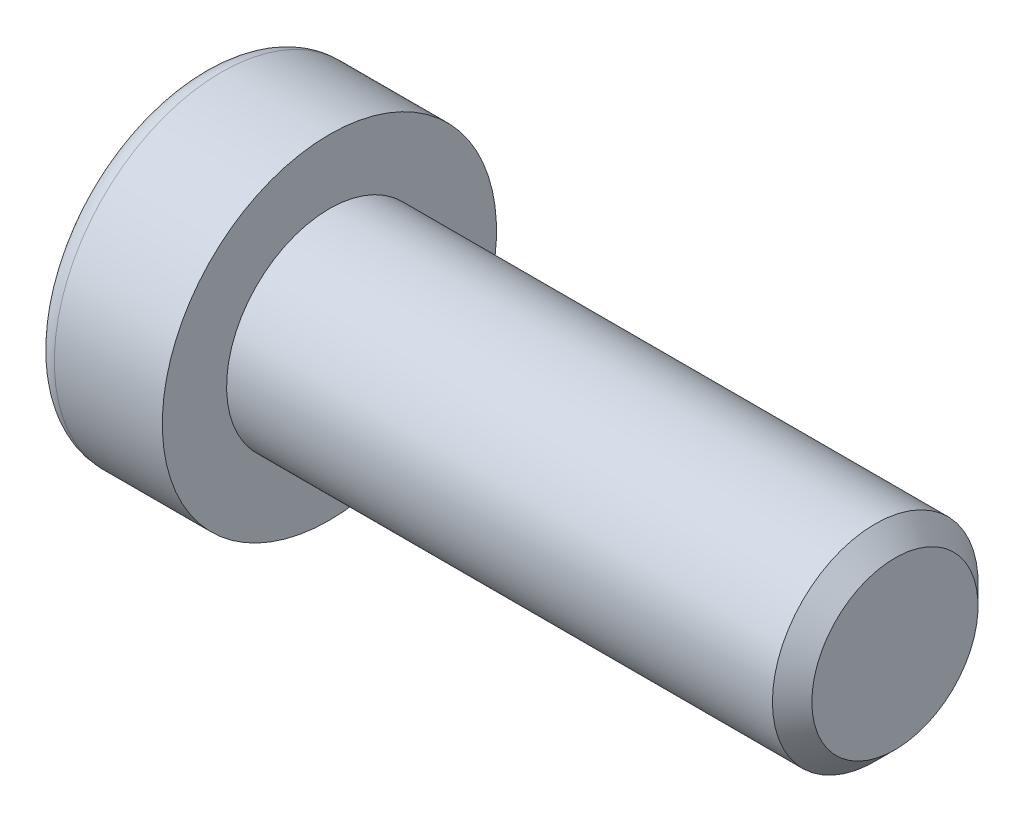
ISO-10303-21;
HEADER;
FILE_DESCRIPTION(('STEP AP214'),'2;1');
FILE_NAME('part.step','',(''),(''),'','','');
FILE_SCHEMA(('AUTOMOTIVE_DESIGN { 1 0 10303 214 1 1 1 1 }'));
ENDSEC;
DATA;
#1=APPLICATION_CONTEXT('core data for automotive mechanical design processes');
#2=APPLICATION_PROTOCOL_DEFINITION('international standard','automotive_design',2000,#1);
#3=PRODUCT_CONTEXT('',#1,'mechanical');
#4=PRODUCT('Part','Part','',(#3));
#5=PRODUCT_RELATED_PRODUCT_CATEGORY('part','',(#4));
#6=PRODUCT_DEFINITION_FORMATION('','',#4);
#7=PRODUCT_DEFINITION_CONTEXT('part definition',#1,'design');
#8=PRODUCT_DEFINITION('design','',#6,#7);
#9=PRODUCT_DEFINITION_SHAPE('','',#8);
#10=(LENGTH_UNIT() NAMED_UNIT(*) SI_UNIT(.MILLI.,.METRE.));
#11=(NAMED_UNIT(*) PLANE_ANGLE_UNIT() SI_UNIT($,.RADIAN.));
#12=(NAMED_UNIT(*) SI_UNIT($,.STERADIAN.) SOLID_ANGLE_UNIT());
#13=UNCERTAINTY_MEASURE_WITH_UNIT(LENGTH_MEASURE(1.E-05),#10,'distance_accuracy_value','');
#14=(GEOMETRIC_REPRESENTATION_CONTEXT(3) GLOBAL_UNCERTAINTY_ASSIGNED_CONTEXT((#13)) GLOBAL_UNIT_ASSIGNED_CONTEXT((#10,
#11,#12)) REPRESENTATION_CONTEXT('',''));
#15=CARTESIAN_POINT('',(0.,0.,0.));
#16=DIRECTION('',(0.,0.,1.));
#17=DIRECTION('',(1.,0.,0.));
#18=AXIS2_PLACEMENT_3D('',#15,#16,#17);
#19=CARTESIAN_POINT('',(-1.21000000177673,0.,0.));
#20=DIRECTION('',(-1.,0.,0.));
#21=DIRECTION('',(0.,0.,1.));
#22=AXIS2_PLACEMENT_3D('',#19,#20,#21);
#23=CONICAL_SURFACE('',#22,2.9040718530382,1.04719754996794);
#24=CARTESIAN_POINT('',(0.466666669012739,-1.13686837721616E-10,0.));
#25=VERTEX_POINT('',#24);
#26=VERTEX_LOOP('',#25);
#27=FACE_BOUND('',#26,.T.);
#28=CARTESIAN_POINT('',(-1.20000000188032,2.50000000042828,1.44337567243126));
#29=CARTESIAN_POINT('',(-1.16336943336427,2.50000000015382,1.31652043353318));
#30=CARTESIAN_POINT('',(-1.13005584831707,2.50000000004123,1.18857018203745));
#31=CARTESIAN_POINT('',(-1.07190798610144,2.49999999995868,0.930454306037677));
#32=CARTESIAN_POINT('',(-1.04709427719735,2.49999999998906,0.800284096806924));
#33=CARTESIAN_POINT('',(-1.00846995036617,2.50000000001067,0.541556812494233));
#34=CARTESIAN_POINT('',(-0.994402236162447,2.50000000000284,0.413039534770439));
#35=CARTESIAN_POINT('',(-0.977611461824864,2.49999999999716,0.155400578562858));
#36=CARTESIAN_POINT('',(-0.974874494142074,2.49999999999929,0.02627983588409));
#37=CARTESIAN_POINT('',(-0.980582864422355,2.50000000000062,-0.21496841995549));
#38=CARTESIAN_POINT('',(-0.987626608278002,2.50000000000017,-0.327132134383147));
#39=CARTESIAN_POINT('',(-1.00994662771906,2.49999999999983,-0.550728853222557));
#40=CARTESIAN_POINT('',(-1.02523052031715,2.49999999999995,-0.66216108485018));
#41=CARTESIAN_POINT('',(-1.06343729360609,2.50000000000005,-0.886218434015897));
#42=CARTESIAN_POINT('',(-1.08652205474861,2.50000000000003,-0.998815208377871));
#43=CARTESIAN_POINT('',(-1.13891470311393,2.49999999999998,-1.2223298619213));
#44=CARTESIAN_POINT('',(-1.16821028805135,2.49999999999995,-1.33325060237494));
#45=CARTESIAN_POINT('',(-1.20000000215881,2.5,-1.44337567242466));
#46=B_SPLINE_CURVE_WITH_KNOTS('',3,(#28,#29,#30,#31,#32,#33,#34,#35,#36,#37,#38,#39,#40,#41,#42,
#43,#44,#45),.UNSPECIFIED.,.F.,.F.,(4,2,2,2,2,2,2,2,4),(0.,0.396270014515872,0.793492271437725,
1.18088450788727,1.56780111135406,1.90463472821334,2.24178024186127,2.58640202744164,
2.93034746593166),.UNSPECIFIED.);
#47=CARTESIAN_POINT('',(-1.20000000213914,2.49999999973261,1.44337567281968));
#48=VERTEX_POINT('',#47);
#49=CARTESIAN_POINT('',(-1.20000000222827,2.5,-1.44337567266531));
#50=VERTEX_POINT('',#49);
#51=EDGE_CURVE('E19',#48,#50,#46,.T.);
#52=ORIENTED_EDGE('',*,*,#51,.T.);
#53=CARTESIAN_POINT('',(-1.20000000188032,2.49999999974406,-1.44337567361636));
#54=CARTESIAN_POINT('',(-1.16336943336427,2.39014014011794,-1.50680329282772));
#55=CARTESIAN_POINT('',(-1.13005584831707,2.27933197184574,-1.57077841847808));
#56=CARTESIAN_POINT('',(-1.07190798610144,2.05579706606859,-1.69983635640647));
#57=CARTESIAN_POINT('',(-1.04709427719735,1.94306635807401,-1.76492146104816));
#58=CARTESIAN_POINT('',(-1.00846995036617,1.71900195721787,-1.89428510322322));
#59=CARTESIAN_POINT('',(-0.994402236162447,1.60770272987993,-1.95854374207834));
#60=CARTESIAN_POINT('',(-0.977611461824864,1.38458084879682,-2.08736322017721));
#61=CARTESIAN_POINT('',(-0.974874494142074,1.27275900548255,-2.15192359151843));
#62=CARTESIAN_POINT('',(-0.980582864422354,1.06383188730746,-2.27254771943938));
#63=CARTESIAN_POINT('',(-0.987626608278001,0.966695261230055,-2.32862957665281));
#64=CARTESIAN_POINT('',(-1.00994662771905,0.773054822512112,-2.44042793607223));
#65=CARTESIAN_POINT('',(-1.02523052031715,0.676551679122258,-2.49614405188614));
#66=CARTESIAN_POINT('',(-1.06343729360609,0.482512322840196,-2.60817272646909));
#67=CARTESIAN_POINT('',(-1.08652205474861,0.385000655858529,-2.66447111365005));
#68=CARTESIAN_POINT('',(-1.13891470311393,0.191431287771819,-2.77622844042172));
#69=CARTESIAN_POINT('',(-1.16821028805135,0.09537110873237,-2.83168881064853));
#70=CARTESIAN_POINT('',(-1.20000000215881,4.75795596297873E-10,-2.88675134567343));
#71=B_SPLINE_CURVE_WITH_KNOTS('',3,(#53,#54,#55,#56,#57,#58,#59,#60,#61,#62,#63,#64,#65,#66,#67,
#68,#69,#70),.UNSPECIFIED.,.F.,.F.,(4,2,2,2,2,2,2,2,4),(0.,0.396270014515871,0.793492271437724,
1.18088450788727,1.56780111135406,1.90463472821334,2.24178024186127,2.58640202744164,
2.93034746593166),.UNSPECIFIED.);
#72=CARTESIAN_POINT('',(-1.20000000213914,0.,-2.88675134563937));
#73=VERTEX_POINT('',#72);
#74=EDGE_CURVE('E79',#50,#73,#71,.T.);
#75=ORIENTED_EDGE('',*,*,#74,.T.);
#76=CARTESIAN_POINT('',(-1.20000000188032,-6.84219602122337E-10,-2.88675134604762));
#77=CARTESIAN_POINT('',(-1.16336943336427,-0.109859860035873,-2.8233237263609));
#78=CARTESIAN_POINT('',(-1.13005584831707,-0.220668028195489,-2.75934860051552));
#79=CARTESIAN_POINT('',(-1.07190798610144,-0.444202933890087,-2.63029066244415));
#80=CARTESIAN_POINT('',(-1.04709427719735,-0.556933641915047,-2.56520555785509));
#81=CARTESIAN_POINT('',(-1.00846995036617,-0.780998042792801,-2.43584191571745));
#82=CARTESIAN_POINT('',(-0.994402236162447,-0.892297270122914,-2.37158327684878));
#83=CARTESIAN_POINT('',(-0.977611461824864,-1.11541915120034,-2.24276379874007));
#84=CARTESIAN_POINT('',(-0.974874494142073,-1.22724099451673,-2.17820342740253));
#85=CARTESIAN_POINT('',(-0.980582864422354,-1.43616811269316,-2.05757929948389));
#86=CARTESIAN_POINT('',(-0.987626608278001,-1.53330473877011,-2.00149744226967));
#87=CARTESIAN_POINT('',(-1.00994662771906,-1.72694517748772,-1.88969908284967));
#88=CARTESIAN_POINT('',(-1.02523052031715,-1.82344832087769,-1.83398296703597));
#89=CARTESIAN_POINT('',(-1.06343729360609,-2.01748767715985,-1.72195429245319));
#90=CARTESIAN_POINT('',(-1.08652205474861,-2.1149993441415,-1.66565590527218));
#91=CARTESIAN_POINT('',(-1.13891470311393,-2.30856871222816,-1.55389857850043));
#92=CARTESIAN_POINT('',(-1.16821028805135,-2.40462889126758,-1.49843820827358));
#93=CARTESIAN_POINT('',(-1.20000000215881,-2.49999999952421,-1.44337567324877));
#94=B_SPLINE_CURVE_WITH_KNOTS('',3,(#76,#77,#78,#79,#80,#81,#82,#83,#84,#85,#86,#87,#88,#89,#90,
#91,#92,#93),.UNSPECIFIED.,.F.,.F.,(4,2,2,2,2,2,2,2,4),(0.,0.396270014515872,0.793492271437725,
1.18088450788727,1.56780111135406,1.90463472821334,2.24178024186127,2.58640202744164,
2.93034746593167),.UNSPECIFIED.);
#95=CARTESIAN_POINT('',(-1.20000000213914,-2.49999999973261,-1.44337567281968));
#96=VERTEX_POINT('',#95);
#97=EDGE_CURVE('E104',#73,#96,#94,.T.);
#98=ORIENTED_EDGE('',*,*,#97,.T.);
#99=CARTESIAN_POINT('',(-1.20000000188032,-2.50000000042828,-1.44337567243126));
#100=CARTESIAN_POINT('',(-1.16336943336427,-2.50000000015382,-1.31652043353318));
#101=CARTESIAN_POINT('',(-1.13005584831707,-2.50000000004123,-1.18857018203745));
#102=CARTESIAN_POINT('',(-1.07190798610144,-2.49999999995868,-0.93045430603768));
#103=CARTESIAN_POINT('',(-1.04709427719735,-2.49999999998906,-0.800284096806928));
#104=CARTESIAN_POINT('',(-1.00846995036617,-2.50000000001067,-0.541556812494236));
#105=CARTESIAN_POINT('',(-0.994402236162447,-2.50000000000284,-0.413039534770443));
#106=CARTESIAN_POINT('',(-0.977611461824863,-2.49999999999716,-0.155400578562862));
#107=CARTESIAN_POINT('',(-0.974874494142073,-2.49999999999929,-0.0262798358840941));
#108=CARTESIAN_POINT('',(-0.980582864422354,-2.50000000000062,0.214968419955486));
#109=CARTESIAN_POINT('',(-0.987626608278001,-2.50000000000017,0.327132134383144));
#110=CARTESIAN_POINT('',(-1.00994662771905,-2.49999999999983,0.550728853222554));
#111=CARTESIAN_POINT('',(-1.02523052031715,-2.49999999999995,0.662161084850177));
#112=CARTESIAN_POINT('',(-1.06343729360609,-2.50000000000005,0.886218434015895));
#113=CARTESIAN_POINT('',(-1.08652205474861,-2.50000000000002,0.99881520837787));
#114=CARTESIAN_POINT('',(-1.13891470311393,-2.49999999999998,1.2223298619213));
#115=CARTESIAN_POINT('',(-1.16821028805135,-2.49999999999995,1.33325060237494));
#116=CARTESIAN_POINT('',(-1.20000000215881,-2.5,1.44337567242466));
#117=B_SPLINE_CURVE_WITH_KNOTS('',3,(#99,#100,#101,#102,#103,#104,#105,#106,#107,#108,#109,#110,
#111,#112,#113,#114,#115,#116),.UNSPECIFIED.,.F.,.F.,(4,2,2,2,2,2,2,2,4),(0.,0.396270014515872,
0.793492271437724,1.18088450788727,1.56780111135406,1.90463472821334,2.24178024186127,
2.58640202744164,2.93034746593167),.UNSPECIFIED.);
#118=CARTESIAN_POINT('',(-1.20000000213914,-2.49999999973261,1.44337567281969));
#119=VERTEX_POINT('',#118);
#120=EDGE_CURVE('E128',#96,#119,#117,.T.);
#121=ORIENTED_EDGE('',*,*,#120,.T.);
#122=CARTESIAN_POINT('',(-1.20000000188032,-2.49999999974406,1.44337567361636));
#123=CARTESIAN_POINT('',(-1.16336943336427,-2.39014014011795,1.50680329282772));
#124=CARTESIAN_POINT('',(-1.13005584831707,-2.27933197184574,1.57077841847807));
#125=CARTESIAN_POINT('',(-1.07190798610144,-2.05579706606859,1.69983635640647));
#126=CARTESIAN_POINT('',(-1.04709427719735,-1.94306635807401,1.76492146104816));
#127=CARTESIAN_POINT('',(-1.00846995036617,-1.71900195721787,1.89428510322322));
#128=CARTESIAN_POINT('',(-0.994402236162447,-1.60770272987993,1.95854374207834));
#129=CARTESIAN_POINT('',(-0.977611461824864,-1.38458084879682,2.08736322017721));
#130=CARTESIAN_POINT('',(-0.974874494142074,-1.27275900548255,2.15192359151843));
#131=CARTESIAN_POINT('',(-0.980582864422354,-1.06383188730746,2.27254771943938));
#132=CARTESIAN_POINT('',(-0.987626608278001,-0.966695261230056,2.32862957665281));
#133=CARTESIAN_POINT('',(-1.00994662771905,-0.773054822512113,2.44042793607223));
#134=CARTESIAN_POINT('',(-1.02523052031715,-0.676551679122259,2.49614405188614));
#135=CARTESIAN_POINT('',(-1.06343729360609,-0.482512322840196,2.60817272646909));
#136=CARTESIAN_POINT('',(-1.08652205474861,-0.385000655858529,2.66447111365005));
#137=CARTESIAN_POINT('',(-1.13891470311393,-0.19143128777182,2.77622844042172));
#138=CARTESIAN_POINT('',(-1.16821028805135,-0.0953711087323703,2.83168881064852));
#139=CARTESIAN_POINT('',(-1.20000000215881,-4.75795563263291E-10,2.88675134567343));
#140=B_SPLINE_CURVE_WITH_KNOTS('',3,(#122,#123,#124,#125,#126,#127,#128,#129,#130,#131,#132,
#133,#134,#135,#136,#137,#138,#139),.UNSPECIFIED.,.F.,.F.,(4,2,2,2,2,2,2,2,4),(0.,
0.396270014515872,0.793492271437724,1.18088450788727,1.56780111135406,1.90463472821334,
2.24178024186127,2.58640202744164,2.93034746593167),.UNSPECIFIED.);
#141=CARTESIAN_POINT('',(-1.20000000213914,0.,2.88675134563937));
#142=VERTEX_POINT('',#141);
#143=EDGE_CURVE('E136',#119,#142,#140,.T.);
#144=ORIENTED_EDGE('',*,*,#143,.T.);
#145=CARTESIAN_POINT('',(-1.20000000188032,6.84218409417226E-10,2.88675134604763));
#146=CARTESIAN_POINT('',(-1.16336943336427,0.109859860035872,2.8233237263609));
#147=CARTESIAN_POINT('',(-1.13005584831707,0.220668028195487,2.75934860051552));
#148=CARTESIAN_POINT('',(-1.07190798610144,0.444202933890086,2.63029066244415));
#149=CARTESIAN_POINT('',(-1.04709427719735,0.556933641915045,2.56520555785509));
#150=CARTESIAN_POINT('',(-1.00846995036617,0.780998042792799,2.43584191571745));
#151=CARTESIAN_POINT('',(-0.994402236162446,0.892297270122912,2.37158327684878));
#152=CARTESIAN_POINT('',(-0.977611461824863,1.11541915120034,2.24276379874007));
#153=CARTESIAN_POINT('',(-0.974874494142073,1.22724099451673,2.17820342740253));
#154=CARTESIAN_POINT('',(-0.980582864422353,1.43616811269316,2.05757929948389));
#155=CARTESIAN_POINT('',(-0.987626608278,1.53330473877011,2.00149744226967));
#156=CARTESIAN_POINT('',(-1.00994662771905,1.72694517748772,1.88969908284967));
#157=CARTESIAN_POINT('',(-1.02523052031715,1.82344832087769,1.83398296703596));
#158=CARTESIAN_POINT('',(-1.06343729360609,2.01748767715985,1.72195429245319));
#159=CARTESIAN_POINT('',(-1.08652205474861,2.1149993441415,1.66565590527218));
#160=CARTESIAN_POINT('',(-1.13891470311393,2.30856871222816,1.55389857850042));
#161=CARTESIAN_POINT('',(-1.16821028805135,2.40462889126758,1.49843820827358));
#162=CARTESIAN_POINT('',(-1.2000000021588,2.49999999952421,1.44337567324876));
#163=B_SPLINE_CURVE_WITH_KNOTS('',3,(#145,#146,#147,#148,#149,#150,#151,#152,#153,#154,#155,
#156,#157,#158,#159,#160,#161,#162),.UNSPECIFIED.,.F.,.F.,(4,2,2,2,2,2,2,2,4),(0.,
0.396270014515872,0.793492271437725,1.18088450788727,1.56780111135406,1.90463472821334,
2.24178024186127,2.58640202744164,2.93034746593167),.UNSPECIFIED.);
#164=EDGE_CURVE('E81',#142,#48,#163,.T.);
#165=ORIENTED_EDGE('',*,*,#164,.T.);
#166=EDGE_LOOP('',(#52,#75,#98,#121,#144,#165));
#167=FACE_BOUND('',#166,.T.);
#168=ADVANCED_FACE('F15',(#27,#167),#23,.F.);
#169=CARTESIAN_POINT('',(-5.,2.5,1.44337567297406));
#170=DIRECTION('',(0.,1.,0.));
#171=DIRECTION('',(0.,0.,1.));
#172=AXIS2_PLACEMENT_3D('',#169,#170,#171);
#173=PLANE('',#172);
#174=DIRECTION('',(1.,0.,0.));
#175=VECTOR('',#174,1.);
#176=CARTESIAN_POINT('',(-5.,2.5,1.44337567297406));
#177=LINE('',#176,#175);
#178=CARTESIAN_POINT('',(-5.,2.5,1.44337567297406));
#179=VERTEX_POINT('',#178);
#180=EDGE_CURVE('E83',#48,#179,#177,.F.);
#181=ORIENTED_EDGE('',*,*,#180,.T.);
#182=DIRECTION('',(0.,0.,1.));
#183=VECTOR('',#182,1.);
#184=CARTESIAN_POINT('',(-5.,2.5,0.));
#185=LINE('',#184,#183);
#186=CARTESIAN_POINT('',(-5.,2.5,-1.44337567297407));
#187=VERTEX_POINT('',#186);
#188=EDGE_CURVE('E88',#187,#179,#185,.T.);
#189=ORIENTED_EDGE('',*,*,#188,.F.);
#190=DIRECTION('',(1.,0.,0.));
#191=VECTOR('',#190,1.);
#192=CARTESIAN_POINT('',(-5.,2.5,-1.44337567297407));
#193=LINE('',#192,#191);
#194=EDGE_CURVE('E86',#187,#50,#193,.T.);
#195=ORIENTED_EDGE('',*,*,#194,.T.);
#196=ORIENTED_EDGE('',*,*,#51,.F.);
#197=EDGE_LOOP('',(#181,#189,#195,#196));
#198=FACE_BOUND('',#197,.T.);
#199=ADVANCED_FACE('F75',(#198),#173,.F.);
#200=CARTESIAN_POINT('',(-5.,0.,2.88675134594813));
#201=DIRECTION('',(0.,0.500000000000001,0.866025403784438));
#202=DIRECTION('',(0.,-0.866025403784438,0.500000000000001));
#203=AXIS2_PLACEMENT_3D('',#200,#201,#202);
#204=PLANE('',#203);
#205=DIRECTION('',(1.,0.,0.));
#206=VECTOR('',#205,1.);
#207=CARTESIAN_POINT('',(-5.,0.,2.88675134594813));
#208=LINE('',#207,#206);
#209=CARTESIAN_POINT('',(-5.,0.,2.88675134594813));
#210=VERTEX_POINT('',#209);
#211=EDGE_CURVE('E140',#142,#210,#208,.F.);
#212=ORIENTED_EDGE('',*,*,#211,.T.);
#213=DIRECTION('',(0.,-0.866025403784438,0.500000000000001));
#214=VECTOR('',#213,1.);
#215=CARTESIAN_POINT('',(-5.,2.5,1.44337567297406));
#216=LINE('',#215,#214);
#217=EDGE_CURVE('E94',#179,#210,#216,.T.);
#218=ORIENTED_EDGE('',*,*,#217,.F.);
#219=ORIENTED_EDGE('',*,*,#180,.F.);
#220=ORIENTED_EDGE('',*,*,#164,.F.);
#221=EDGE_LOOP('',(#212,#218,#219,#220));
#222=FACE_BOUND('',#221,.T.);
#223=ADVANCED_FACE('F144',(#222),#204,.F.);
#224=CARTESIAN_POINT('',(-5.,-2.5,1.44337567297406));
#225=DIRECTION('',(0.,-0.5,0.866025403784439));
#226=DIRECTION('',(0.,-0.866025403784439,-0.5));
#227=AXIS2_PLACEMENT_3D('',#224,#225,#226);
#228=PLANE('',#227);
#229=DIRECTION('',(1.,0.,0.));
#230=VECTOR('',#229,1.);
#231=CARTESIAN_POINT('',(-5.,-2.5,1.44337567297406));
#232=LINE('',#231,#230);
#233=CARTESIAN_POINT('',(-5.,-2.5,1.44337567297406));
#234=VERTEX_POINT('',#233);
#235=EDGE_CURVE('E135',#119,#234,#232,.F.);
#236=ORIENTED_EDGE('',*,*,#235,.T.);
#237=DIRECTION('',(0.,-0.866025403784439,-0.5));
#238=VECTOR('',#237,1.);
#239=CARTESIAN_POINT('',(-5.,0.,2.88675134594813));
#240=LINE('',#239,#238);
#241=EDGE_CURVE('E223',#210,#234,#240,.T.);
#242=ORIENTED_EDGE('',*,*,#241,.F.);
#243=ORIENTED_EDGE('',*,*,#211,.F.);
#244=ORIENTED_EDGE('',*,*,#143,.F.);
#245=EDGE_LOOP('',(#236,#242,#243,#244));
#246=FACE_BOUND('',#245,.T.);
#247=ADVANCED_FACE('F124',(#246),#228,.F.);
#248=CARTESIAN_POINT('',(-5.,-2.5,-1.44337567297406));
#249=DIRECTION('',(0.,-1.,0.));
#250=DIRECTION('',(0.,0.,-1.));
#251=AXIS2_PLACEMENT_3D('',#248,#249,#250);
#252=PLANE('',#251);
#253=DIRECTION('',(1.,0.,0.));
#254=VECTOR('',#253,1.);
#255=CARTESIAN_POINT('',(-5.,-2.5,-1.44337567297406));
#256=LINE('',#255,#254);
#257=CARTESIAN_POINT('',(-5.,-2.5,-1.44337567297406));
#258=VERTEX_POINT('',#257);
#259=EDGE_CURVE('E134',#96,#258,#256,.F.);
#260=ORIENTED_EDGE('',*,*,#259,.T.);
#261=DIRECTION('',(0.,0.,1.));
#262=VECTOR('',#261,1.);
#263=CARTESIAN_POINT('',(-5.,-2.5,0.));
#264=LINE('',#263,#262);
#265=EDGE_CURVE('E220',#234,#258,#264,.F.);
#266=ORIENTED_EDGE('',*,*,#265,.F.);
#267=ORIENTED_EDGE('',*,*,#235,.F.);
#268=ORIENTED_EDGE('',*,*,#120,.F.);
#269=EDGE_LOOP('',(#260,#266,#267,#268));
#270=FACE_BOUND('',#269,.T.);
#271=ADVANCED_FACE('F120',(#270),#252,.F.);
#272=CARTESIAN_POINT('',(-5.,0.,-2.88675134594813));
#273=DIRECTION('',(0.,-0.5,-0.866025403784439));
#274=DIRECTION('',(0.,0.866025403784439,-0.5));
#275=AXIS2_PLACEMENT_3D('',#272,#273,#274);
#276=PLANE('',#275);
#277=DIRECTION('',(1.,0.,0.));
#278=VECTOR('',#277,1.);
#279=CARTESIAN_POINT('',(-5.,0.,-2.88675134594813));
#280=LINE('',#279,#278);
#281=CARTESIAN_POINT('',(-5.,0.,-2.88675134594813));
#282=VERTEX_POINT('',#281);
#283=EDGE_CURVE('E37',#73,#282,#280,.F.);
#284=ORIENTED_EDGE('',*,*,#283,.T.);
#285=DIRECTION('',(0.,0.866025403784438,-0.500000000000001));
#286=VECTOR('',#285,1.);
#287=CARTESIAN_POINT('',(-5.,-2.5,-1.44337567297406));
#288=LINE('',#287,#286);
#289=EDGE_CURVE('E217',#258,#282,#288,.T.);
#290=ORIENTED_EDGE('',*,*,#289,.F.);
#291=ORIENTED_EDGE('',*,*,#259,.F.);
#292=ORIENTED_EDGE('',*,*,#97,.F.);
#293=EDGE_LOOP('',(#284,#290,#291,#292));
#294=FACE_BOUND('',#293,.T.);
#295=ADVANCED_FACE('F114',(#294),#276,.F.);
#296=CARTESIAN_POINT('',(-5.,2.5,-1.44337567297407));
#297=DIRECTION('',(0.,0.5,-0.866025403784439));
#298=DIRECTION('',(0.,0.866025403784439,0.5));
#299=AXIS2_PLACEMENT_3D('',#296,#297,#298);
#300=PLANE('',#299);
#301=ORIENTED_EDGE('',*,*,#194,.F.);
#302=DIRECTION('',(0.,0.866025403784439,0.5));
#303=VECTOR('',#302,1.);
#304=CARTESIAN_POINT('',(-5.,0.,-2.88675134594813));
#305=LINE('',#304,#303);
#306=EDGE_CURVE('E215',#282,#187,#305,.T.);
#307=ORIENTED_EDGE('',*,*,#306,.F.);
#308=ORIENTED_EDGE('',*,*,#283,.F.);
#309=ORIENTED_EDGE('',*,*,#74,.F.);
#310=EDGE_LOOP('',(#301,#307,#308,#309));
#311=FACE_BOUND('',#310,.T.);
#312=ADVANCED_FACE('F92',(#311),#300,.F.);
#313=CARTESIAN_POINT('',(-5.,4.69337567297407,0.));
#314=DIRECTION('',(-1.,0.,0.));
#315=DIRECTION('',(0.,0.,1.));
#316=AXIS2_PLACEMENT_3D('',#313,#314,#315);
#317=PLANE('',#316);
#318=ORIENTED_EDGE('',*,*,#289,.T.);
#319=ORIENTED_EDGE('',*,*,#306,.T.);
#320=ORIENTED_EDGE('',*,*,#188,.T.);
#321=ORIENTED_EDGE('',*,*,#217,.T.);
#322=ORIENTED_EDGE('',*,*,#241,.T.);
#323=ORIENTED_EDGE('',*,*,#265,.T.);
#324=EDGE_LOOP('',(#318,#319,#320,#321,#322,#323));
#325=FACE_BOUND('',#324,.T.);
#326=CARTESIAN_POINT('',(-5.,0.,0.));
#327=DIRECTION('',(1.,0.,0.));
#328=DIRECTION('',(0.,1.,0.));
#329=AXIS2_PLACEMENT_3D('',#326,#327,#328);
#330=CIRCLE('',#329,5.7);
#331=CARTESIAN_POINT('',(-5.,5.7,0.));
#332=VERTEX_POINT('',#331);
#333=EDGE_CURVE('E192',#332,#332,#330,.T.);
#334=ORIENTED_EDGE('',*,*,#333,.F.);
#335=EDGE_LOOP('',(#334));
#336=FACE_BOUND('',#335,.T.);
#337=ADVANCED_FACE('F113',(#325,#336),#317,.T.);
#338=CARTESIAN_POINT('',(-4.2,0.,0.));
#339=DIRECTION('',(1.,0.,0.));
#340=DIRECTION('',(0.,0.,-1.));
#341=AXIS2_PLACEMENT_3D('',#338,#339,#340);
#342=TOROIDAL_SURFACE('',#341,5.7,0.8);
#343=CARTESIAN_POINT('',(-4.2,0.,0.));
#344=DIRECTION('',(1.,0.,0.));
#345=DIRECTION('',(0.,1.,0.));
#346=AXIS2_PLACEMENT_3D('',#343,#344,#345);
#347=CIRCLE('',#346,6.5);
#348=CARTESIAN_POINT('',(-4.2,6.5,0.));
#349=VERTEX_POINT('',#348);
#350=EDGE_CURVE('E233',#349,#349,#347,.T.);
#351=ORIENTED_EDGE('',*,*,#350,.F.);
#352=EDGE_LOOP('',(#351));
#353=FACE_BOUND('',#352,.T.);
#354=ORIENTED_EDGE('',*,*,#333,.T.);
#355=EDGE_LOOP('',(#354));
#356=FACE_BOUND('',#355,.T.);
#357=ADVANCED_FACE('F176',(#353,#356),#342,.T.);
#358=CARTESIAN_POINT('',(-2.5,0.,0.));
#359=DIRECTION('',(1.,0.,0.));
#360=DIRECTION('',(0.,1.,0.));
#361=AXIS2_PLACEMENT_3D('',#358,#359,#360);
#362=CYLINDRICAL_SURFACE('',#361,6.5);
#363=ORIENTED_EDGE('',*,*,#350,.T.);
#364=EDGE_LOOP('',(#363));
#365=FACE_BOUND('',#364,.T.);
#366=CARTESIAN_POINT('',(0.,0.,0.));
#367=DIRECTION('',(1.,0.,0.));
#368=DIRECTION('',(0.,1.,0.));
#369=AXIS2_PLACEMENT_3D('',#366,#367,#368);
#370=CIRCLE('',#369,6.5);
#371=CARTESIAN_POINT('',(0.,6.5,0.));
#372=VERTEX_POINT('',#371);
#373=EDGE_CURVE('E102',#372,#372,#370,.T.);
#374=ORIENTED_EDGE('',*,*,#373,.F.);
#375=EDGE_LOOP('',(#374));
#376=FACE_BOUND('',#375,.T.);
#377=ADVANCED_FACE('F173',(#365,#376),#362,.T.);
#378=CARTESIAN_POINT('',(22.,2.,0.));
#379=DIRECTION('',(1.,0.,0.));
#380=DIRECTION('',(0.,0.,-1.));
#381=AXIS2_PLACEMENT_3D('',#378,#379,#380);
#382=PLANE('',#381);
#383=CARTESIAN_POINT('',(22.0000000003324,0.,0.));
#384=DIRECTION('',(-1.,0.,0.));
#385=DIRECTION('',(0.,0.,1.));
#386=AXIS2_PLACEMENT_3D('',#383,#384,#385);
#387=CIRCLE('',#386,3.23318750042745);
#388=CARTESIAN_POINT('',(22.0000000003324,0.,3.23318750042745));
#389=VERTEX_POINT('',#388);
#390=EDGE_CURVE('E229',#389,#389,#387,.T.);
#391=ORIENTED_EDGE('',*,*,#390,.F.);
#392=EDGE_LOOP('',(#391));
#393=FACE_BOUND('',#392,.T.);
#394=ADVANCED_FACE('F169',(#393),#382,.T.);
#395=CARTESIAN_POINT('',(0.,5.25,0.));
#396=DIRECTION('',(1.,0.,0.));
#397=DIRECTION('',(0.,0.,-1.));
#398=AXIS2_PLACEMENT_3D('',#395,#396,#397);
#399=PLANE('',#398);
#400=CARTESIAN_POINT('',(0.,0.,0.));
#401=DIRECTION('',(1.,0.,0.));
#402=DIRECTION('',(0.,1.,0.));
#403=AXIS2_PLACEMENT_3D('',#400,#401,#402);
#404=CIRCLE('',#403,4.);
#405=CARTESIAN_POINT('',(0.,4.,0.));
#406=VERTEX_POINT('',#405);
#407=EDGE_CURVE('E28',#406,#406,#404,.T.);
#408=ORIENTED_EDGE('',*,*,#407,.F.);
#409=EDGE_LOOP('',(#408));
#410=FACE_BOUND('',#409,.T.);
#411=ORIENTED_EDGE('',*,*,#373,.T.);
#412=EDGE_LOOP('',(#411));
#413=FACE_BOUND('',#412,.T.);
#414=ADVANCED_FACE('F162',(#410,#413),#399,.T.);
#415=CARTESIAN_POINT('',(21.2331874997744,0.,0.));
#416=DIRECTION('',(-1.,0.,0.));
#417=DIRECTION('',(0.,0.,1.));
#418=AXIS2_PLACEMENT_3D('',#415,#416,#417);
#419=CONICAL_SURFACE('',#418,3.99999999956435,0.78539816247083);
#420=ORIENTED_EDGE('',*,*,#390,.T.);
#421=EDGE_LOOP('',(#420));
#422=FACE_BOUND('',#421,.T.);
#423=CARTESIAN_POINT('',(21.2331875,0.,0.));
#424=DIRECTION('',(1.,0.,0.));
#425=DIRECTION('',(0.,1.,0.));
#426=AXIS2_PLACEMENT_3D('',#423,#424,#425);
#427=CIRCLE('',#426,4.);
#428=CARTESIAN_POINT('',(21.2331875,4.,0.));
#429=VERTEX_POINT('',#428);
#430=EDGE_CURVE('E10',#429,#429,#427,.F.);
#431=ORIENTED_EDGE('',*,*,#430,.F.);
#432=EDGE_LOOP('',(#431));
#433=FACE_BOUND('',#432,.T.);
#434=ADVANCED_FACE('F155',(#422,#433),#419,.T.);
#435=CARTESIAN_POINT('',(11.5,0.,0.));
#436=DIRECTION('',(1.,0.,0.));
#437=DIRECTION('',(0.,1.,0.));
#438=AXIS2_PLACEMENT_3D('',#435,#436,#437);
#439=CYLINDRICAL_SURFACE('',#438,4.);
#440=ORIENTED_EDGE('',*,*,#430,.T.);
#441=EDGE_LOOP('',(#440));
#442=FACE_BOUND('',#441,.T.);
#443=ORIENTED_EDGE('',*,*,#407,.T.);
#444=EDGE_LOOP('',(#443));
#445=FACE_BOUND('',#444,.T.);
#446=ADVANCED_FACE('F153',(#442,#445),#439,.T.);
#447=CLOSED_SHELL('',(#168,#199,#223,#247,#271,#295,#312,#337,#357,#377,#394,#414,#434,#446));
#448=MANIFOLD_SOLID_BREP('B1',#447);
#449=ADVANCED_BREP_SHAPE_REPRESENTATION('',(#18,#448),#14);
#450=SHAPE_DEFINITION_REPRESENTATION(#9,#449);
ENDSEC;
END-ISO-10303-21;
